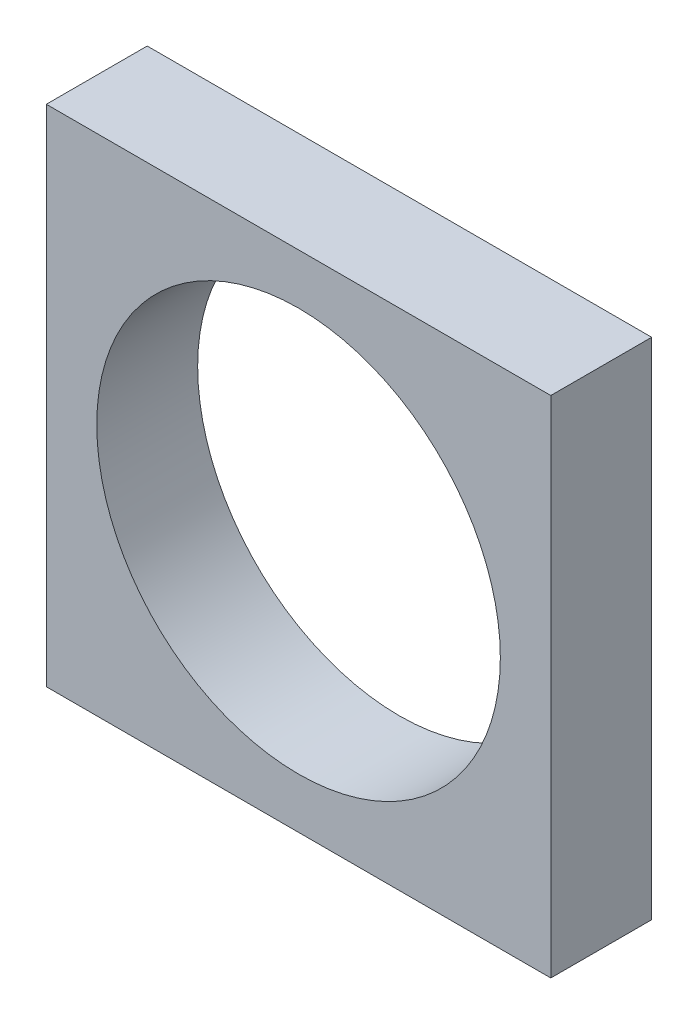
ISO-10303-21;
HEADER;
FILE_DESCRIPTION(('STEP AP214'),'2;1');
FILE_NAME('part.step','',(''),(''),'','','');
FILE_SCHEMA(('AUTOMOTIVE_DESIGN { 1 0 10303 214 1 1 1 1 }'));
ENDSEC;
DATA;
#1=APPLICATION_CONTEXT('core data for automotive mechanical design processes');
#2=APPLICATION_PROTOCOL_DEFINITION('international standard','automotive_design',2000,#1);
#3=PRODUCT_CONTEXT('',#1,'mechanical');
#4=PRODUCT('Part','Part','',(#3));
#5=PRODUCT_RELATED_PRODUCT_CATEGORY('part','',(#4));
#6=PRODUCT_DEFINITION_FORMATION('','',#4);
#7=PRODUCT_DEFINITION_CONTEXT('part definition',#1,'design');
#8=PRODUCT_DEFINITION('design','',#6,#7);
#9=PRODUCT_DEFINITION_SHAPE('','',#8);
#10=(LENGTH_UNIT() NAMED_UNIT(*) SI_UNIT(.MILLI.,.METRE.));
#11=(NAMED_UNIT(*) PLANE_ANGLE_UNIT() SI_UNIT($,.RADIAN.));
#12=(NAMED_UNIT(*) SI_UNIT($,.STERADIAN.) SOLID_ANGLE_UNIT());
#13=UNCERTAINTY_MEASURE_WITH_UNIT(LENGTH_MEASURE(1.E-05),#10,'distance_accuracy_value','');
#14=(GEOMETRIC_REPRESENTATION_CONTEXT(3) GLOBAL_UNCERTAINTY_ASSIGNED_CONTEXT((#13)) GLOBAL_UNIT_ASSIGNED_CONTEXT((#10,
#11,#12)) REPRESENTATION_CONTEXT('',''));
#15=CARTESIAN_POINT('',(0.,0.,0.));
#16=DIRECTION('',(0.,0.,1.));
#17=DIRECTION('',(1.,0.,0.));
#18=AXIS2_PLACEMENT_3D('',#15,#16,#17);
#19=CARTESIAN_POINT('',(50.,50.,20.));
#20=DIRECTION('',(-1.,0.,0.));
#21=DIRECTION('',(0.,-1.,0.));
#22=AXIS2_PLACEMENT_3D('',#19,#20,#21);
#23=PLANE('',#22);
#24=DIRECTION('',(0.,1.,0.));
#25=VECTOR('',#24,1.);
#26=CARTESIAN_POINT('',(50.,50.,0.));
#27=LINE('',#26,#25);
#28=CARTESIAN_POINT('',(50.,-50.,0.));
#29=VERTEX_POINT('',#28);
#30=CARTESIAN_POINT('',(50.,50.,0.));
#31=VERTEX_POINT('',#30);
#32=EDGE_CURVE('E96',#29,#31,#27,.T.);
#33=ORIENTED_EDGE('',*,*,#32,.T.);
#34=DIRECTION('',(0.,0.,-1.));
#35=VECTOR('',#34,1.);
#36=CARTESIAN_POINT('',(50.,50.,20.));
#37=LINE('',#36,#35);
#38=CARTESIAN_POINT('',(50.,50.,20.));
#39=VERTEX_POINT('',#38);
#40=EDGE_CURVE('E11',#39,#31,#37,.T.);
#41=ORIENTED_EDGE('',*,*,#40,.F.);
#42=DIRECTION('',(0.,1.,0.));
#43=VECTOR('',#42,1.);
#44=CARTESIAN_POINT('',(50.,50.,20.));
#45=LINE('',#44,#43);
#46=CARTESIAN_POINT('',(50.,-50.,20.));
#47=VERTEX_POINT('',#46);
#48=EDGE_CURVE('E84',#47,#39,#45,.T.);
#49=ORIENTED_EDGE('',*,*,#48,.F.);
#50=DIRECTION('',(0.,0.,-1.));
#51=VECTOR('',#50,1.);
#52=CARTESIAN_POINT('',(50.,-50.,20.));
#53=LINE('',#52,#51);
#54=EDGE_CURVE('E92',#47,#29,#53,.T.);
#55=ORIENTED_EDGE('',*,*,#54,.T.);
#56=EDGE_LOOP('',(#33,#41,#49,#55));
#57=FACE_BOUND('',#56,.T.);
#58=ADVANCED_FACE('F33',(#57),#23,.F.);
#59=CARTESIAN_POINT('',(-50.,50.,20.));
#60=DIRECTION('',(0.,-1.,0.));
#61=DIRECTION('',(0.,0.,-1.));
#62=AXIS2_PLACEMENT_3D('',#59,#60,#61);
#63=PLANE('',#62);
#64=DIRECTION('',(-1.,0.,0.));
#65=VECTOR('',#64,1.);
#66=CARTESIAN_POINT('',(-50.,50.,0.));
#67=LINE('',#66,#65);
#68=CARTESIAN_POINT('',(-50.,50.,0.));
#69=VERTEX_POINT('',#68);
#70=EDGE_CURVE('E88',#31,#69,#67,.T.);
#71=ORIENTED_EDGE('',*,*,#70,.T.);
#72=DIRECTION('',(0.,0.,-1.));
#73=VECTOR('',#72,1.);
#74=CARTESIAN_POINT('',(-50.,50.,20.));
#75=LINE('',#74,#73);
#76=CARTESIAN_POINT('',(-50.,50.,20.));
#77=VERTEX_POINT('',#76);
#78=EDGE_CURVE('E41',#77,#69,#75,.T.);
#79=ORIENTED_EDGE('',*,*,#78,.F.);
#80=DIRECTION('',(-1.,0.,0.));
#81=VECTOR('',#80,1.);
#82=CARTESIAN_POINT('',(-50.,50.,20.));
#83=LINE('',#82,#81);
#84=EDGE_CURVE('E79',#39,#77,#83,.T.);
#85=ORIENTED_EDGE('',*,*,#84,.F.);
#86=ORIENTED_EDGE('',*,*,#40,.T.);
#87=EDGE_LOOP('',(#71,#79,#85,#86));
#88=FACE_BOUND('',#87,.T.);
#89=ADVANCED_FACE('F87',(#88),#63,.F.);
#90=CARTESIAN_POINT('',(-50.,50.,20.));
#91=DIRECTION('',(1.,0.,0.));
#92=DIRECTION('',(0.,1.,0.));
#93=AXIS2_PLACEMENT_3D('',#90,#91,#92);
#94=PLANE('',#93);
#95=DIRECTION('',(0.,-1.,0.));
#96=VECTOR('',#95,1.);
#97=CARTESIAN_POINT('',(-50.,50.,0.));
#98=LINE('',#97,#96);
#99=CARTESIAN_POINT('',(-50.,-50.,0.));
#100=VERTEX_POINT('',#99);
#101=EDGE_CURVE('E66',#69,#100,#98,.T.);
#102=ORIENTED_EDGE('',*,*,#101,.T.);
#103=DIRECTION('',(0.,0.,-1.));
#104=VECTOR('',#103,1.);
#105=CARTESIAN_POINT('',(-50.,-50.,20.));
#106=LINE('',#105,#104);
#107=CARTESIAN_POINT('',(-50.,-50.,20.));
#108=VERTEX_POINT('',#107);
#109=EDGE_CURVE('E89',#108,#100,#106,.T.);
#110=ORIENTED_EDGE('',*,*,#109,.F.);
#111=DIRECTION('',(0.,-1.,0.));
#112=VECTOR('',#111,1.);
#113=CARTESIAN_POINT('',(-50.,50.,20.));
#114=LINE('',#113,#112);
#115=EDGE_CURVE('E82',#77,#108,#114,.T.);
#116=ORIENTED_EDGE('',*,*,#115,.F.);
#117=ORIENTED_EDGE('',*,*,#78,.T.);
#118=EDGE_LOOP('',(#102,#110,#116,#117));
#119=FACE_BOUND('',#118,.T.);
#120=ADVANCED_FACE('F90',(#119),#94,.F.);
#121=CARTESIAN_POINT('',(-50.,-50.,20.));
#122=DIRECTION('',(0.,1.,0.));
#123=DIRECTION('',(0.,0.,1.));
#124=AXIS2_PLACEMENT_3D('',#121,#122,#123);
#125=PLANE('',#124);
#126=DIRECTION('',(1.,0.,0.));
#127=VECTOR('',#126,1.);
#128=CARTESIAN_POINT('',(-50.,-50.,0.));
#129=LINE('',#128,#127);
#130=EDGE_CURVE('E72',#100,#29,#129,.T.);
#131=ORIENTED_EDGE('',*,*,#130,.T.);
#132=ORIENTED_EDGE('',*,*,#54,.F.);
#133=DIRECTION('',(1.,0.,0.));
#134=VECTOR('',#133,1.);
#135=CARTESIAN_POINT('',(-50.,-50.,20.));
#136=LINE('',#135,#134);
#137=EDGE_CURVE('E49',#108,#47,#136,.T.);
#138=ORIENTED_EDGE('',*,*,#137,.F.);
#139=ORIENTED_EDGE('',*,*,#109,.T.);
#140=EDGE_LOOP('',(#131,#132,#138,#139));
#141=FACE_BOUND('',#140,.T.);
#142=ADVANCED_FACE('F104',(#141),#125,.F.);
#143=CARTESIAN_POINT('',(0.,0.,20.));
#144=DIRECTION('',(0.,0.,1.));
#145=DIRECTION('',(1.,0.,0.));
#146=AXIS2_PLACEMENT_3D('',#143,#144,#145);
#147=PLANE('',#146);
#148=CARTESIAN_POINT('',(0.,0.,20.));
#149=DIRECTION('',(0.,0.,1.));
#150=DIRECTION('',(1.,0.,0.));
#151=AXIS2_PLACEMENT_3D('',#148,#149,#150);
#152=CIRCLE('',#151,40.);
#153=CARTESIAN_POINT('',(40.,0.,20.));
#154=VERTEX_POINT('',#153);
#155=EDGE_CURVE('E110',#154,#154,#152,.T.);
#156=ORIENTED_EDGE('',*,*,#155,.F.);
#157=EDGE_LOOP('',(#156));
#158=FACE_BOUND('',#157,.T.);
#159=ORIENTED_EDGE('',*,*,#48,.T.);
#160=ORIENTED_EDGE('',*,*,#84,.T.);
#161=ORIENTED_EDGE('',*,*,#115,.T.);
#162=ORIENTED_EDGE('',*,*,#137,.T.);
#163=EDGE_LOOP('',(#159,#160,#161,#162));
#164=FACE_BOUND('',#163,.T.);
#165=ADVANCED_FACE('F80',(#158,#164),#147,.T.);
#166=CARTESIAN_POINT('',(0.,0.,0.));
#167=DIRECTION('',(0.,0.,1.));
#168=DIRECTION('',(1.,0.,0.));
#169=AXIS2_PLACEMENT_3D('',#166,#167,#168);
#170=PLANE('',#169);
#171=CARTESIAN_POINT('',(0.,0.,0.));
#172=DIRECTION('',(0.,0.,1.));
#173=DIRECTION('',(1.,0.,0.));
#174=AXIS2_PLACEMENT_3D('',#171,#172,#173);
#175=CIRCLE('',#174,40.);
#176=CARTESIAN_POINT('',(40.,0.,0.));
#177=VERTEX_POINT('',#176);
#178=EDGE_CURVE('E99',#177,#177,#175,.T.);
#179=ORIENTED_EDGE('',*,*,#178,.T.);
#180=EDGE_LOOP('',(#179));
#181=FACE_BOUND('',#180,.T.);
#182=ORIENTED_EDGE('',*,*,#32,.F.);
#183=ORIENTED_EDGE('',*,*,#130,.F.);
#184=ORIENTED_EDGE('',*,*,#101,.F.);
#185=ORIENTED_EDGE('',*,*,#70,.F.);
#186=EDGE_LOOP('',(#182,#183,#184,#185));
#187=FACE_BOUND('',#186,.T.);
#188=ADVANCED_FACE('F107',(#181,#187),#170,.F.);
#189=CARTESIAN_POINT('',(0.,0.,0.));
#190=DIRECTION('',(0.,0.,1.));
#191=DIRECTION('',(1.,0.,0.));
#192=AXIS2_PLACEMENT_3D('',#189,#190,#191);
#193=CYLINDRICAL_SURFACE('',#192,40.);
#194=ORIENTED_EDGE('',*,*,#178,.F.);
#195=EDGE_LOOP('',(#194));
#196=FACE_BOUND('',#195,.T.);
#197=ORIENTED_EDGE('',*,*,#155,.T.);
#198=EDGE_LOOP('',(#197));
#199=FACE_BOUND('',#198,.T.);
#200=ADVANCED_FACE('F117',(#196,#199),#193,.F.);
#201=CLOSED_SHELL('',(#58,#89,#120,#142,#165,#188,#200));
#202=MANIFOLD_SOLID_BREP('B2',#201);
#203=ADVANCED_BREP_SHAPE_REPRESENTATION('',(#18,#202),#14);
#204=SHAPE_DEFINITION_REPRESENTATION(#9,#203);
ENDSEC;
END-ISO-10303-21;
